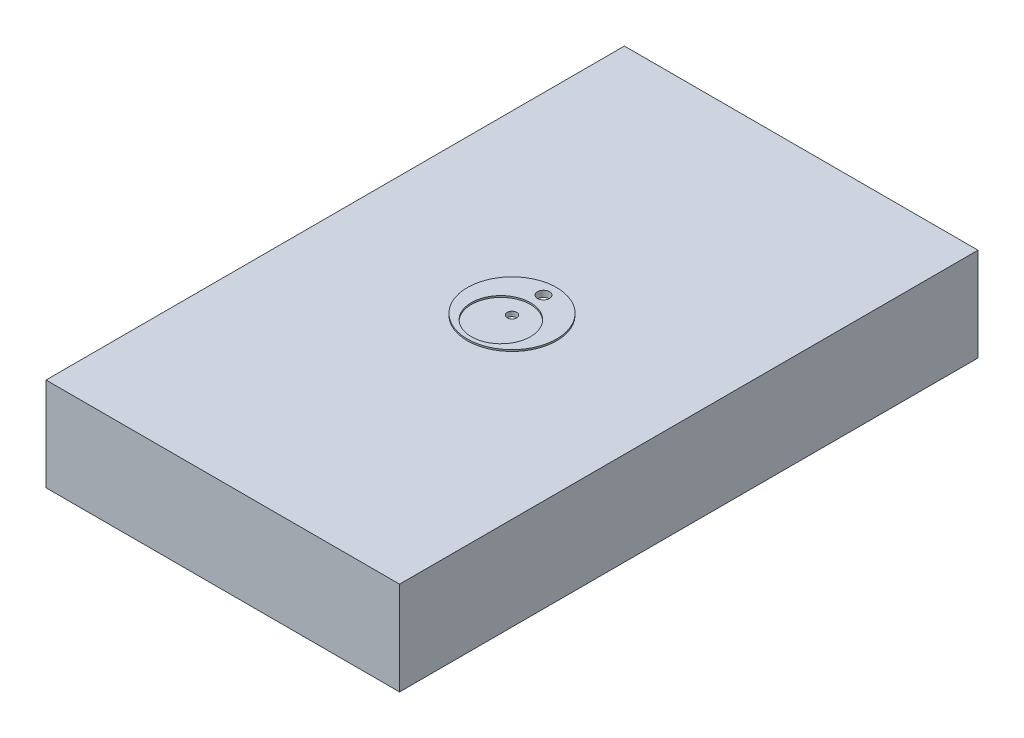
ISO-10303-21;
HEADER;
FILE_DESCRIPTION(('STEP AP214'),'2;1');
FILE_NAME('part.step','',(''),(''),'','','');
FILE_SCHEMA(('AUTOMOTIVE_DESIGN { 1 0 10303 214 1 1 1 1 }'));
ENDSEC;
DATA;
#1=APPLICATION_CONTEXT('core data for automotive mechanical design processes');
#2=APPLICATION_PROTOCOL_DEFINITION('international standard','automotive_design',2000,#1);
#3=PRODUCT_CONTEXT('',#1,'mechanical');
#4=PRODUCT('Part','Part','',(#3));
#5=PRODUCT_RELATED_PRODUCT_CATEGORY('part','',(#4));
#6=PRODUCT_DEFINITION_FORMATION('','',#4);
#7=PRODUCT_DEFINITION_CONTEXT('part definition',#1,'design');
#8=PRODUCT_DEFINITION('design','',#6,#7);
#9=PRODUCT_DEFINITION_SHAPE('','',#8);
#10=(LENGTH_UNIT() NAMED_UNIT(*) SI_UNIT(.MILLI.,.METRE.));
#11=(NAMED_UNIT(*) PLANE_ANGLE_UNIT() SI_UNIT($,.RADIAN.));
#12=(NAMED_UNIT(*) SI_UNIT($,.STERADIAN.) SOLID_ANGLE_UNIT());
#13=UNCERTAINTY_MEASURE_WITH_UNIT(LENGTH_MEASURE(1.E-05),#10,'distance_accuracy_value','');
#14=(GEOMETRIC_REPRESENTATION_CONTEXT(3) GLOBAL_UNCERTAINTY_ASSIGNED_CONTEXT((#13)) GLOBAL_UNIT_ASSIGNED_CONTEXT((#10,
#11,#12)) REPRESENTATION_CONTEXT('',''));
#15=CARTESIAN_POINT('',(0.,0.,0.));
#16=DIRECTION('',(0.,0.,1.));
#17=DIRECTION('',(1.,0.,0.));
#18=AXIS2_PLACEMENT_3D('',#15,#16,#17);
#19=CARTESIAN_POINT('',(0.,1.,0.));
#20=DIRECTION('',(0.,-1.,0.));
#21=DIRECTION('',(0.,0.,-1.));
#22=AXIS2_PLACEMENT_3D('',#19,#20,#21);
#23=CYLINDRICAL_SURFACE('',#22,28.1);
#24=CARTESIAN_POINT('',(0.,1.,0.));
#25=DIRECTION('',(0.,1.,0.));
#26=DIRECTION('',(0.,0.,1.));
#27=AXIS2_PLACEMENT_3D('',#24,#25,#26);
#28=CIRCLE('',#27,28.1);
#29=CARTESIAN_POINT('',(0.,1.,28.1));
#30=VERTEX_POINT('',#29);
#31=EDGE_CURVE('E11',#30,#30,#28,.T.);
#32=ORIENTED_EDGE('',*,*,#31,.F.);
#33=EDGE_LOOP('',(#32));
#34=FACE_BOUND('',#33,.T.);
#35=CARTESIAN_POINT('',(0.,0.,0.));
#36=DIRECTION('',(0.,1.,0.));
#37=DIRECTION('',(0.,0.,1.));
#38=AXIS2_PLACEMENT_3D('',#35,#36,#37);
#39=CIRCLE('',#38,28.1);
#40=CARTESIAN_POINT('',(0.,0.,28.1));
#41=VERTEX_POINT('',#40);
#42=EDGE_CURVE('E178',#41,#41,#39,.T.);
#43=ORIENTED_EDGE('',*,*,#42,.T.);
#44=EDGE_LOOP('',(#43));
#45=FACE_BOUND('',#44,.T.);
#46=ADVANCED_FACE('F37',(#34,#45),#23,.T.);
#47=CARTESIAN_POINT('',(0.,1.,0.));
#48=DIRECTION('',(0.,1.,0.));
#49=DIRECTION('',(0.,0.,1.));
#50=AXIS2_PLACEMENT_3D('',#47,#48,#49);
#51=PLANE('',#50);
#52=CARTESIAN_POINT('',(0.,1.,-19.85));
#53=DIRECTION('',(0.,1.,0.));
#54=DIRECTION('',(0.,0.,1.));
#55=AXIS2_PLACEMENT_3D('',#52,#53,#54);
#56=CIRCLE('',#55,3.75);
#57=CARTESIAN_POINT('',(0.,1.,-16.1));
#58=VERTEX_POINT('',#57);
#59=EDGE_CURVE('E139',#58,#58,#56,.T.);
#60=ORIENTED_EDGE('',*,*,#59,.F.);
#61=EDGE_LOOP('',(#60));
#62=FACE_BOUND('',#61,.T.);
#63=CARTESIAN_POINT('',(0.,1.,7.));
#64=DIRECTION('',(0.,1.,0.));
#65=DIRECTION('',(0.,0.,1.));
#66=AXIS2_PLACEMENT_3D('',#63,#64,#65);
#67=CIRCLE('',#66,18.6);
#68=CARTESIAN_POINT('',(0.,1.,25.6));
#69=VERTEX_POINT('',#68);
#70=EDGE_CURVE('E179',#69,#69,#67,.T.);
#71=ORIENTED_EDGE('',*,*,#70,.F.);
#72=EDGE_LOOP('',(#71));
#73=FACE_BOUND('',#72,.T.);
#74=ORIENTED_EDGE('',*,*,#31,.T.);
#75=EDGE_LOOP('',(#74));
#76=FACE_BOUND('',#75,.T.);
#77=ADVANCED_FACE('F214',(#62,#73,#76),#51,.T.);
#78=CARTESIAN_POINT('',(0.,-57.8,7.));
#79=DIRECTION('',(0.,1.,0.));
#80=DIRECTION('',(0.,0.,1.));
#81=AXIS2_PLACEMENT_3D('',#78,#79,#80);
#82=CYLINDRICAL_SURFACE('',#81,18.6);
#83=ORIENTED_EDGE('',*,*,#70,.T.);
#84=EDGE_LOOP('',(#83));
#85=FACE_BOUND('',#84,.T.);
#86=CARTESIAN_POINT('',(0.,0.,7.));
#87=DIRECTION('',(0.,1.,0.));
#88=DIRECTION('',(0.,0.,1.));
#89=AXIS2_PLACEMENT_3D('',#86,#87,#88);
#90=CIRCLE('',#89,18.6);
#91=CARTESIAN_POINT('',(0.,0.,25.6));
#92=VERTEX_POINT('',#91);
#93=EDGE_CURVE('E45',#92,#92,#90,.T.);
#94=ORIENTED_EDGE('',*,*,#93,.F.);
#95=EDGE_LOOP('',(#94));
#96=FACE_BOUND('',#95,.T.);
#97=ADVANCED_FACE('F219',(#85,#96),#82,.F.);
#98=CARTESIAN_POINT('',(0.,0.,0.));
#99=DIRECTION('',(0.,-1.,0.));
#100=DIRECTION('',(0.,0.,-1.));
#101=AXIS2_PLACEMENT_3D('',#98,#99,#100);
#102=PLANE('',#101);
#103=ORIENTED_EDGE('',*,*,#42,.F.);
#104=EDGE_LOOP('',(#103));
#105=FACE_BOUND('',#104,.T.);
#106=DIRECTION('',(0.,0.,1.));
#107=VECTOR('',#106,1.);
#108=CARTESIAN_POINT('',(111.341546011374,0.,182.141376200391));
#109=LINE('',#108,#107);
#110=CARTESIAN_POINT('',(111.341546011374,0.,-182.141376200391));
#111=VERTEX_POINT('',#110);
#112=CARTESIAN_POINT('',(111.341546011374,0.,182.141376200391));
#113=VERTEX_POINT('',#112);
#114=EDGE_CURVE('E152',#111,#113,#109,.T.);
#115=ORIENTED_EDGE('',*,*,#114,.F.);
#116=DIRECTION('',(1.,0.,0.));
#117=VECTOR('',#116,1.);
#118=CARTESIAN_POINT('',(-111.341546011374,0.,-182.141376200391));
#119=LINE('',#118,#117);
#120=CARTESIAN_POINT('',(-111.341546011374,0.,-182.141376200391));
#121=VERTEX_POINT('',#120);
#122=EDGE_CURVE('E83',#121,#111,#119,.T.);
#123=ORIENTED_EDGE('',*,*,#122,.F.);
#124=DIRECTION('',(0.,0.,-1.));
#125=VECTOR('',#124,1.);
#126=CARTESIAN_POINT('',(-111.341546011374,0.,182.141376200391));
#127=LINE('',#126,#125);
#128=CARTESIAN_POINT('',(-111.341546011374,0.,182.141376200391));
#129=VERTEX_POINT('',#128);
#130=EDGE_CURVE('E167',#129,#121,#127,.T.);
#131=ORIENTED_EDGE('',*,*,#130,.F.);
#132=DIRECTION('',(-1.,0.,0.));
#133=VECTOR('',#132,1.);
#134=CARTESIAN_POINT('',(-111.341546011374,0.,182.141376200391));
#135=LINE('',#134,#133);
#136=EDGE_CURVE('E165',#113,#129,#135,.T.);
#137=ORIENTED_EDGE('',*,*,#136,.F.);
#138=EDGE_LOOP('',(#115,#123,#131,#137));
#139=FACE_BOUND('',#138,.T.);
#140=ADVANCED_FACE('F225',(#105,#139),#102,.F.);
#141=CARTESIAN_POINT('',(0.,-58.8,0.));
#142=DIRECTION('',(0.,-1.,0.));
#143=DIRECTION('',(0.,0.,-1.));
#144=AXIS2_PLACEMENT_3D('',#141,#142,#143);
#145=PLANE('',#144);
#146=DIRECTION('',(0.,0.,1.));
#147=VECTOR('',#146,1.);
#148=CARTESIAN_POINT('',(103.958701758156,-58.8,174.272148859892));
#149=LINE('',#148,#147);
#150=CARTESIAN_POINT('',(103.958701758156,-58.8,-174.272148859892));
#151=VERTEX_POINT('',#150);
#152=CARTESIAN_POINT('',(103.958701758156,-58.8,174.272148859892));
#153=VERTEX_POINT('',#152);
#154=EDGE_CURVE('E53',#151,#153,#149,.T.);
#155=ORIENTED_EDGE('',*,*,#154,.F.);
#156=DIRECTION('',(1.,0.,0.));
#157=VECTOR('',#156,1.);
#158=CARTESIAN_POINT('',(-103.958701758156,-58.8,-174.272148859892));
#159=LINE('',#158,#157);
#160=CARTESIAN_POINT('',(-103.958701758156,-58.8,-174.272148859892));
#161=VERTEX_POINT('',#160);
#162=EDGE_CURVE('E133',#161,#151,#159,.T.);
#163=ORIENTED_EDGE('',*,*,#162,.F.);
#164=DIRECTION('',(0.,0.,-1.));
#165=VECTOR('',#164,1.);
#166=CARTESIAN_POINT('',(-103.958701758156,-58.8,174.272148859892));
#167=LINE('',#166,#165);
#168=CARTESIAN_POINT('',(-103.958701758156,-58.8,174.272148859892));
#169=VERTEX_POINT('',#168);
#170=EDGE_CURVE('E136',#169,#161,#167,.T.);
#171=ORIENTED_EDGE('',*,*,#170,.F.);
#172=DIRECTION('',(-1.,0.,0.));
#173=VECTOR('',#172,1.);
#174=CARTESIAN_POINT('',(-103.958701758156,-58.8,174.272148859892));
#175=LINE('',#174,#173);
#176=EDGE_CURVE('E145',#153,#169,#175,.T.);
#177=ORIENTED_EDGE('',*,*,#176,.F.);
#178=EDGE_LOOP('',(#155,#163,#171,#177));
#179=FACE_BOUND('',#178,.T.);
#180=DIRECTION('',(0.,0.,1.));
#181=VECTOR('',#180,1.);
#182=CARTESIAN_POINT('',(111.341546011374,-58.8,182.141376200391));
#183=LINE('',#182,#181);
#184=CARTESIAN_POINT('',(111.341546011374,-58.8,-182.141376200391));
#185=VERTEX_POINT('',#184);
#186=CARTESIAN_POINT('',(111.341546011374,-58.8,182.141376200391));
#187=VERTEX_POINT('',#186);
#188=EDGE_CURVE('E156',#185,#187,#183,.T.);
#189=ORIENTED_EDGE('',*,*,#188,.T.);
#190=DIRECTION('',(-1.,0.,0.));
#191=VECTOR('',#190,1.);
#192=CARTESIAN_POINT('',(-111.341546011374,-58.8,182.141376200391));
#193=LINE('',#192,#191);
#194=CARTESIAN_POINT('',(-111.341546011374,-58.8,182.141376200391));
#195=VERTEX_POINT('',#194);
#196=EDGE_CURVE('E91',#187,#195,#193,.T.);
#197=ORIENTED_EDGE('',*,*,#196,.T.);
#198=DIRECTION('',(0.,0.,-1.));
#199=VECTOR('',#198,1.);
#200=CARTESIAN_POINT('',(-111.341546011374,-58.8,182.141376200391));
#201=LINE('',#200,#199);
#202=CARTESIAN_POINT('',(-111.341546011374,-58.8,-182.141376200391));
#203=VERTEX_POINT('',#202);
#204=EDGE_CURVE('E159',#195,#203,#201,.T.);
#205=ORIENTED_EDGE('',*,*,#204,.T.);
#206=DIRECTION('',(1.,0.,0.));
#207=VECTOR('',#206,1.);
#208=CARTESIAN_POINT('',(-111.341546011374,-58.8,-182.141376200391));
#209=LINE('',#208,#207);
#210=EDGE_CURVE('E62',#203,#185,#209,.T.);
#211=ORIENTED_EDGE('',*,*,#210,.T.);
#212=EDGE_LOOP('',(#189,#197,#205,#211));
#213=FACE_BOUND('',#212,.T.);
#214=ADVANCED_FACE('F228',(#179,#213),#145,.T.);
#215=CARTESIAN_POINT('',(-111.341546011374,-58.8,-182.141376200391));
#216=DIRECTION('',(0.,0.,1.));
#217=DIRECTION('',(1.,0.,0.));
#218=AXIS2_PLACEMENT_3D('',#215,#216,#217);
#219=PLANE('',#218);
#220=ORIENTED_EDGE('',*,*,#122,.T.);
#221=DIRECTION('',(0.,1.,0.));
#222=VECTOR('',#221,1.);
#223=CARTESIAN_POINT('',(111.341546011374,-58.8,-182.141376200391));
#224=LINE('',#223,#222);
#225=EDGE_CURVE('E162',#185,#111,#224,.T.);
#226=ORIENTED_EDGE('',*,*,#225,.F.);
#227=ORIENTED_EDGE('',*,*,#210,.F.);
#228=DIRECTION('',(0.,1.,0.));
#229=VECTOR('',#228,1.);
#230=CARTESIAN_POINT('',(-111.341546011374,-58.8,-182.141376200391));
#231=LINE('',#230,#229);
#232=EDGE_CURVE('E171',#203,#121,#231,.T.);
#233=ORIENTED_EDGE('',*,*,#232,.T.);
#234=EDGE_LOOP('',(#220,#226,#227,#233));
#235=FACE_BOUND('',#234,.T.);
#236=ADVANCED_FACE('F237',(#235),#219,.F.);
#237=CARTESIAN_POINT('',(-111.341546011374,-58.8,182.141376200391));
#238=DIRECTION('',(1.,0.,0.));
#239=DIRECTION('',(0.,0.,-1.));
#240=AXIS2_PLACEMENT_3D('',#237,#238,#239);
#241=PLANE('',#240);
#242=ORIENTED_EDGE('',*,*,#130,.T.);
#243=ORIENTED_EDGE('',*,*,#232,.F.);
#244=ORIENTED_EDGE('',*,*,#204,.F.);
#245=DIRECTION('',(0.,1.,0.));
#246=VECTOR('',#245,1.);
#247=CARTESIAN_POINT('',(-111.341546011374,-58.8,182.141376200391));
#248=LINE('',#247,#246);
#249=EDGE_CURVE('E173',#195,#129,#248,.T.);
#250=ORIENTED_EDGE('',*,*,#249,.T.);
#251=EDGE_LOOP('',(#242,#243,#244,#250));
#252=FACE_BOUND('',#251,.T.);
#253=ADVANCED_FACE('F241',(#252),#241,.F.);
#254=CARTESIAN_POINT('',(-111.341546011374,-58.8,182.141376200391));
#255=DIRECTION('',(0.,0.,-1.));
#256=DIRECTION('',(-1.,0.,0.));
#257=AXIS2_PLACEMENT_3D('',#254,#255,#256);
#258=PLANE('',#257);
#259=ORIENTED_EDGE('',*,*,#136,.T.);
#260=ORIENTED_EDGE('',*,*,#249,.F.);
#261=ORIENTED_EDGE('',*,*,#196,.F.);
#262=DIRECTION('',(0.,1.,0.));
#263=VECTOR('',#262,1.);
#264=CARTESIAN_POINT('',(111.341546011374,-58.8,182.141376200391));
#265=LINE('',#264,#263);
#266=EDGE_CURVE('E176',#187,#113,#265,.T.);
#267=ORIENTED_EDGE('',*,*,#266,.T.);
#268=EDGE_LOOP('',(#259,#260,#261,#267));
#269=FACE_BOUND('',#268,.T.);
#270=ADVANCED_FACE('F242',(#269),#258,.F.);
#271=CARTESIAN_POINT('',(111.341546011374,-58.8,182.141376200391));
#272=DIRECTION('',(-1.,0.,0.));
#273=DIRECTION('',(0.,0.,1.));
#274=AXIS2_PLACEMENT_3D('',#271,#272,#273);
#275=PLANE('',#274);
#276=ORIENTED_EDGE('',*,*,#114,.T.);
#277=ORIENTED_EDGE('',*,*,#266,.F.);
#278=ORIENTED_EDGE('',*,*,#188,.F.);
#279=ORIENTED_EDGE('',*,*,#225,.T.);
#280=EDGE_LOOP('',(#276,#277,#278,#279));
#281=FACE_BOUND('',#280,.T.);
#282=ADVANCED_FACE('F235',(#281),#275,.F.);
#283=CARTESIAN_POINT('',(0.,0.,0.));
#284=DIRECTION('',(0.,-1.,0.));
#285=DIRECTION('',(0.,0.,-1.));
#286=AXIS2_PLACEMENT_3D('',#283,#284,#285);
#287=CIRCLE('',#286,3.);
#288=CARTESIAN_POINT('',(0.,0.,-3.));
#289=VERTEX_POINT('',#288);
#290=EDGE_CURVE('E189',#289,#289,#287,.T.);
#291=ORIENTED_EDGE('',*,*,#290,.T.);
#292=EDGE_LOOP('',(#291));
#293=FACE_BOUND('',#292,.T.);
#294=ORIENTED_EDGE('',*,*,#93,.T.);
#295=EDGE_LOOP('',(#294));
#296=FACE_BOUND('',#295,.T.);
#297=ADVANCED_FACE('F230',(#293,#296),#102,.F.);
#298=CARTESIAN_POINT('',(103.958701758156,-3.,174.272148859892));
#299=DIRECTION('',(1.,0.,0.));
#300=DIRECTION('',(0.,0.,-1.));
#301=AXIS2_PLACEMENT_3D('',#298,#299,#300);
#302=PLANE('',#301);
#303=ORIENTED_EDGE('',*,*,#154,.T.);
#304=DIRECTION('',(0.,-1.,0.));
#305=VECTOR('',#304,1.);
#306=CARTESIAN_POINT('',(103.958701758156,-3.,174.272148859892));
#307=LINE('',#306,#305);
#308=CARTESIAN_POINT('',(103.958701758156,-3.,174.272148859892));
#309=VERTEX_POINT('',#308);
#310=EDGE_CURVE('E111',#309,#153,#307,.T.);
#311=ORIENTED_EDGE('',*,*,#310,.F.);
#312=DIRECTION('',(0.,0.,1.));
#313=VECTOR('',#312,1.);
#314=CARTESIAN_POINT('',(103.958701758156,-3.,174.272148859892));
#315=LINE('',#314,#313);
#316=CARTESIAN_POINT('',(103.958701758156,-3.,-174.272148859892));
#317=VERTEX_POINT('',#316);
#318=EDGE_CURVE('E115',#317,#309,#315,.T.);
#319=ORIENTED_EDGE('',*,*,#318,.F.);
#320=DIRECTION('',(0.,-1.,0.));
#321=VECTOR('',#320,1.);
#322=CARTESIAN_POINT('',(103.958701758156,-3.,-174.272148859892));
#323=LINE('',#322,#321);
#324=EDGE_CURVE('E150',#317,#151,#323,.T.);
#325=ORIENTED_EDGE('',*,*,#324,.T.);
#326=EDGE_LOOP('',(#303,#311,#319,#325));
#327=FACE_BOUND('',#326,.T.);
#328=ADVANCED_FACE('F113',(#327),#302,.F.);
#329=CARTESIAN_POINT('',(-103.958701758156,-3.,-174.272148859892));
#330=DIRECTION('',(0.,0.,-1.));
#331=DIRECTION('',(-1.,0.,0.));
#332=AXIS2_PLACEMENT_3D('',#329,#330,#331);
#333=PLANE('',#332);
#334=ORIENTED_EDGE('',*,*,#162,.T.);
#335=ORIENTED_EDGE('',*,*,#324,.F.);
#336=DIRECTION('',(1.,0.,0.));
#337=VECTOR('',#336,1.);
#338=CARTESIAN_POINT('',(-103.958701758156,-3.,-174.272148859892));
#339=LINE('',#338,#337);
#340=CARTESIAN_POINT('',(-103.958701758156,-3.,-174.272148859892));
#341=VERTEX_POINT('',#340);
#342=EDGE_CURVE('E121',#341,#317,#339,.T.);
#343=ORIENTED_EDGE('',*,*,#342,.F.);
#344=DIRECTION('',(0.,-1.,0.));
#345=VECTOR('',#344,1.);
#346=CARTESIAN_POINT('',(-103.958701758156,-3.,-174.272148859892));
#347=LINE('',#346,#345);
#348=EDGE_CURVE('E153',#341,#161,#347,.T.);
#349=ORIENTED_EDGE('',*,*,#348,.T.);
#350=EDGE_LOOP('',(#334,#335,#343,#349));
#351=FACE_BOUND('',#350,.T.);
#352=ADVANCED_FACE('F265',(#351),#333,.F.);
#353=CARTESIAN_POINT('',(-103.958701758156,-3.,174.272148859892));
#354=DIRECTION('',(-1.,0.,0.));
#355=DIRECTION('',(0.,0.,1.));
#356=AXIS2_PLACEMENT_3D('',#353,#354,#355);
#357=PLANE('',#356);
#358=ORIENTED_EDGE('',*,*,#170,.T.);
#359=ORIENTED_EDGE('',*,*,#348,.F.);
#360=DIRECTION('',(0.,0.,-1.));
#361=VECTOR('',#360,1.);
#362=CARTESIAN_POINT('',(-103.958701758156,-3.,174.272148859892));
#363=LINE('',#362,#361);
#364=CARTESIAN_POINT('',(-103.958701758156,-3.,174.272148859892));
#365=VERTEX_POINT('',#364);
#366=EDGE_CURVE('E129',#365,#341,#363,.T.);
#367=ORIENTED_EDGE('',*,*,#366,.F.);
#368=DIRECTION('',(0.,-1.,0.));
#369=VECTOR('',#368,1.);
#370=CARTESIAN_POINT('',(-103.958701758156,-3.,174.272148859892));
#371=LINE('',#370,#369);
#372=EDGE_CURVE('E120',#365,#169,#371,.T.);
#373=ORIENTED_EDGE('',*,*,#372,.T.);
#374=EDGE_LOOP('',(#358,#359,#367,#373));
#375=FACE_BOUND('',#374,.T.);
#376=ADVANCED_FACE('F210',(#375),#357,.F.);
#377=CARTESIAN_POINT('',(-103.958701758156,-3.,174.272148859892));
#378=DIRECTION('',(0.,0.,1.));
#379=DIRECTION('',(1.,0.,0.));
#380=AXIS2_PLACEMENT_3D('',#377,#378,#379);
#381=PLANE('',#380);
#382=ORIENTED_EDGE('',*,*,#176,.T.);
#383=ORIENTED_EDGE('',*,*,#372,.F.);
#384=DIRECTION('',(-1.,0.,0.));
#385=VECTOR('',#384,1.);
#386=CARTESIAN_POINT('',(-103.958701758156,-3.,174.272148859892));
#387=LINE('',#386,#385);
#388=EDGE_CURVE('E124',#309,#365,#387,.T.);
#389=ORIENTED_EDGE('',*,*,#388,.F.);
#390=ORIENTED_EDGE('',*,*,#310,.T.);
#391=EDGE_LOOP('',(#382,#383,#389,#390));
#392=FACE_BOUND('',#391,.T.);
#393=ADVANCED_FACE('F125',(#392),#381,.F.);
#394=CARTESIAN_POINT('',(0.,-3.,0.));
#395=DIRECTION('',(0.,-1.,0.));
#396=DIRECTION('',(0.,0.,-1.));
#397=AXIS2_PLACEMENT_3D('',#394,#395,#396);
#398=PLANE('',#397);
#399=CARTESIAN_POINT('',(0.,-3.,0.));
#400=DIRECTION('',(0.,-1.,0.));
#401=DIRECTION('',(0.,0.,-1.));
#402=AXIS2_PLACEMENT_3D('',#399,#400,#401);
#403=CIRCLE('',#402,3.);
#404=CARTESIAN_POINT('',(0.,-3.,-3.));
#405=VERTEX_POINT('',#404);
#406=EDGE_CURVE('E40',#405,#405,#403,.T.);
#407=ORIENTED_EDGE('',*,*,#406,.F.);
#408=EDGE_LOOP('',(#407));
#409=FACE_BOUND('',#408,.T.);
#410=CARTESIAN_POINT('',(0.,-3.,-19.85));
#411=DIRECTION('',(0.,-1.,0.));
#412=DIRECTION('',(0.,0.,-1.));
#413=AXIS2_PLACEMENT_3D('',#410,#411,#412);
#414=CIRCLE('',#413,3.75);
#415=CARTESIAN_POINT('',(0.,-3.,-23.6));
#416=VERTEX_POINT('',#415);
#417=EDGE_CURVE('E146',#416,#416,#414,.T.);
#418=ORIENTED_EDGE('',*,*,#417,.F.);
#419=EDGE_LOOP('',(#418));
#420=FACE_BOUND('',#419,.T.);
#421=ORIENTED_EDGE('',*,*,#318,.T.);
#422=ORIENTED_EDGE('',*,*,#388,.T.);
#423=ORIENTED_EDGE('',*,*,#366,.T.);
#424=ORIENTED_EDGE('',*,*,#342,.T.);
#425=EDGE_LOOP('',(#421,#422,#423,#424));
#426=FACE_BOUND('',#425,.T.);
#427=ADVANCED_FACE('F131',(#409,#420,#426),#398,.T.);
#428=CARTESIAN_POINT('',(0.,-9.,-19.85));
#429=DIRECTION('',(0.,1.,0.));
#430=DIRECTION('',(0.,0.,1.));
#431=AXIS2_PLACEMENT_3D('',#428,#429,#430);
#432=CYLINDRICAL_SURFACE('',#431,3.75);
#433=ORIENTED_EDGE('',*,*,#417,.T.);
#434=EDGE_LOOP('',(#433));
#435=FACE_BOUND('',#434,.T.);
#436=ORIENTED_EDGE('',*,*,#59,.T.);
#437=EDGE_LOOP('',(#436));
#438=FACE_BOUND('',#437,.T.);
#439=ADVANCED_FACE('F203',(#435,#438),#432,.F.);
#440=CARTESIAN_POINT('',(0.,-9.,0.));
#441=DIRECTION('',(0.,1.,0.));
#442=DIRECTION('',(0.,0.,1.));
#443=AXIS2_PLACEMENT_3D('',#440,#441,#442);
#444=CYLINDRICAL_SURFACE('',#443,3.);
#445=ORIENTED_EDGE('',*,*,#406,.T.);
#446=EDGE_LOOP('',(#445));
#447=FACE_BOUND('',#446,.T.);
#448=ORIENTED_EDGE('',*,*,#290,.F.);
#449=EDGE_LOOP('',(#448));
#450=FACE_BOUND('',#449,.T.);
#451=ADVANCED_FACE('F198',(#447,#450),#444,.F.);
#452=CLOSED_SHELL('',(#46,#77,#97,#140,#214,#236,#253,#270,#282,#297,#328,#352,#376,#393,#427,
#439,#451));
#453=MANIFOLD_SOLID_BREP('B2',#452);
#454=ADVANCED_BREP_SHAPE_REPRESENTATION('',(#18,#453),#14);
#455=SHAPE_DEFINITION_REPRESENTATION(#9,#454);
ENDSEC;
END-ISO-10303-21;
